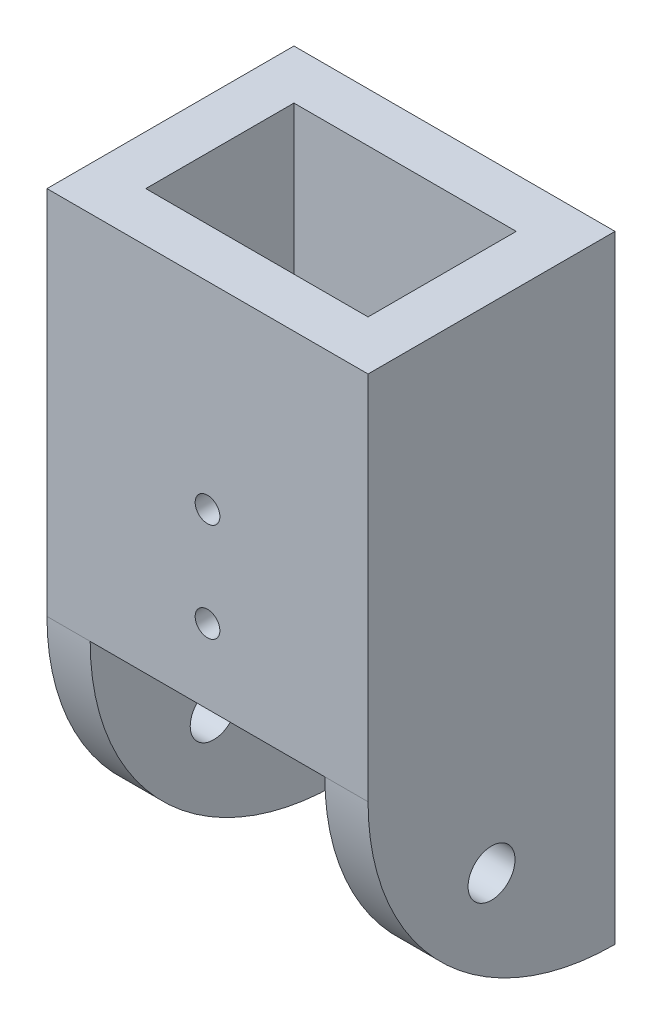
ISO-10303-21;
HEADER;
FILE_DESCRIPTION(('STEP AP214'),'2;1');
FILE_NAME('part.step','',(''),(''),'','','');
FILE_SCHEMA(('AUTOMOTIVE_DESIGN { 1 0 10303 214 1 1 1 1 }'));
ENDSEC;
DATA;
#1=APPLICATION_CONTEXT('core data for automotive mechanical design processes');
#2=APPLICATION_PROTOCOL_DEFINITION('international standard','automotive_design',2000,#1);
#3=PRODUCT_CONTEXT('',#1,'mechanical');
#4=PRODUCT('Part','Part','',(#3));
#5=PRODUCT_RELATED_PRODUCT_CATEGORY('part','',(#4));
#6=PRODUCT_DEFINITION_FORMATION('','',#4);
#7=PRODUCT_DEFINITION_CONTEXT('part definition',#1,'design');
#8=PRODUCT_DEFINITION('design','',#6,#7);
#9=PRODUCT_DEFINITION_SHAPE('','',#8);
#10=(LENGTH_UNIT() NAMED_UNIT(*) SI_UNIT(.MILLI.,.METRE.));
#11=(NAMED_UNIT(*) PLANE_ANGLE_UNIT() SI_UNIT($,.RADIAN.));
#12=(NAMED_UNIT(*) SI_UNIT($,.STERADIAN.) SOLID_ANGLE_UNIT());
#13=UNCERTAINTY_MEASURE_WITH_UNIT(LENGTH_MEASURE(1.E-05),#10,'distance_accuracy_value','');
#14=(GEOMETRIC_REPRESENTATION_CONTEXT(3) GLOBAL_UNCERTAINTY_ASSIGNED_CONTEXT((#13)) GLOBAL_UNIT_ASSIGNED_CONTEXT((#10,
#11,#12)) REPRESENTATION_CONTEXT('',''));
#15=CARTESIAN_POINT('',(0.,0.,0.));
#16=DIRECTION('',(0.,0.,1.));
#17=DIRECTION('',(1.,0.,0.));
#18=AXIS2_PLACEMENT_3D('',#15,#16,#17);
#19=CARTESIAN_POINT('',(0.,0.,0.));
#20=DIRECTION('',(0.,-1.,0.));
#21=DIRECTION('',(0.,0.,-1.));
#22=AXIS2_PLACEMENT_3D('',#19,#20,#21);
#23=PLANE('',#22);
#24=DIRECTION('',(1.,0.,0.));
#25=VECTOR('',#24,1.);
#26=CARTESIAN_POINT('',(-4.5,0.,3.));
#27=LINE('',#26,#25);
#28=CARTESIAN_POINT('',(-4.5,0.,3.));
#29=VERTEX_POINT('',#28);
#30=CARTESIAN_POINT('',(4.5,0.,3.));
#31=VERTEX_POINT('',#30);
#32=EDGE_CURVE('E254',#29,#31,#27,.T.);
#33=ORIENTED_EDGE('',*,*,#32,.T.);
#34=DIRECTION('',(0.,0.,1.));
#35=VECTOR('',#34,1.);
#36=CARTESIAN_POINT('',(4.5,0.,-5.));
#37=LINE('',#36,#35);
#38=CARTESIAN_POINT('',(4.5,0.,-3.));
#39=VERTEX_POINT('',#38);
#40=EDGE_CURVE('E526',#39,#31,#37,.T.);
#41=ORIENTED_EDGE('',*,*,#40,.F.);
#42=DIRECTION('',(-1.,0.,0.));
#43=VECTOR('',#42,1.);
#44=CARTESIAN_POINT('',(-4.5,0.,-3.));
#45=LINE('',#44,#43);
#46=CARTESIAN_POINT('',(-4.5,0.,-3.));
#47=VERTEX_POINT('',#46);
#48=EDGE_CURVE('E248',#39,#47,#45,.T.);
#49=ORIENTED_EDGE('',*,*,#48,.T.);
#50=DIRECTION('',(0.,0.,1.));
#51=VECTOR('',#50,1.);
#52=CARTESIAN_POINT('',(-4.5,0.,-5.));
#53=LINE('',#52,#51);
#54=EDGE_CURVE('E145',#47,#29,#53,.T.);
#55=ORIENTED_EDGE('',*,*,#54,.T.);
#56=EDGE_LOOP('',(#33,#41,#49,#55));
#57=FACE_BOUND('',#56,.T.);
#58=DIRECTION('',(1.,0.,0.));
#59=VECTOR('',#58,1.);
#60=CARTESIAN_POINT('',(4.5,0.,5.));
#61=LINE('',#60,#59);
#62=CARTESIAN_POINT('',(-4.75,0.,5.));
#63=VERTEX_POINT('',#62);
#64=CARTESIAN_POINT('',(4.75,0.,5.));
#65=VERTEX_POINT('',#64);
#66=EDGE_CURVE('E127',#63,#65,#61,.T.);
#67=ORIENTED_EDGE('',*,*,#66,.F.);
#68=DIRECTION('',(0.,0.,1.));
#69=VECTOR('',#68,1.);
#70=CARTESIAN_POINT('',(-4.75,0.,-5.));
#71=LINE('',#70,#69);
#72=CARTESIAN_POINT('',(-4.75,0.,-5.));
#73=VERTEX_POINT('',#72);
#74=EDGE_CURVE('E129',#73,#63,#71,.T.);
#75=ORIENTED_EDGE('',*,*,#74,.F.);
#76=DIRECTION('',(-1.,0.,0.));
#77=VECTOR('',#76,1.);
#78=CARTESIAN_POINT('',(-6.5,0.,-5.));
#79=LINE('',#78,#77);
#80=CARTESIAN_POINT('',(4.75,0.,-5.));
#81=VERTEX_POINT('',#80);
#82=EDGE_CURVE('E164',#81,#73,#79,.T.);
#83=ORIENTED_EDGE('',*,*,#82,.F.);
#84=DIRECTION('',(0.,0.,1.));
#85=VECTOR('',#84,1.);
#86=CARTESIAN_POINT('',(4.75,0.,-5.));
#87=LINE('',#86,#85);
#88=EDGE_CURVE('E59',#81,#65,#87,.T.);
#89=ORIENTED_EDGE('',*,*,#88,.T.);
#90=EDGE_LOOP('',(#67,#75,#83,#89));
#91=FACE_BOUND('',#90,.T.);
#92=ADVANCED_FACE('F41',(#57,#91),#23,.T.);
#93=CARTESIAN_POINT('',(0.,15.,0.));
#94=DIRECTION('',(0.,-1.,0.));
#95=DIRECTION('',(0.,0.,-1.));
#96=AXIS2_PLACEMENT_3D('',#93,#94,#95);
#97=PLANE('',#96);
#98=DIRECTION('',(0.,0.,-1.));
#99=VECTOR('',#98,1.);
#100=CARTESIAN_POINT('',(6.5,15.,5.));
#101=LINE('',#100,#99);
#102=CARTESIAN_POINT('',(6.5,15.,5.));
#103=VERTEX_POINT('',#102);
#104=CARTESIAN_POINT('',(6.5,15.,-5.));
#105=VERTEX_POINT('',#104);
#106=EDGE_CURVE('E163',#103,#105,#101,.T.);
#107=ORIENTED_EDGE('',*,*,#106,.T.);
#108=DIRECTION('',(-1.,0.,0.));
#109=VECTOR('',#108,1.);
#110=CARTESIAN_POINT('',(-6.5,15.,-5.));
#111=LINE('',#110,#109);
#112=CARTESIAN_POINT('',(-6.5,15.,-5.));
#113=VERTEX_POINT('',#112);
#114=EDGE_CURVE('E169',#105,#113,#111,.T.);
#115=ORIENTED_EDGE('',*,*,#114,.T.);
#116=DIRECTION('',(0.,0.,1.));
#117=VECTOR('',#116,1.);
#118=CARTESIAN_POINT('',(-6.5,15.,5.));
#119=LINE('',#118,#117);
#120=CARTESIAN_POINT('',(-6.5,15.,5.));
#121=VERTEX_POINT('',#120);
#122=EDGE_CURVE('E284',#113,#121,#119,.T.);
#123=ORIENTED_EDGE('',*,*,#122,.T.);
#124=DIRECTION('',(1.,0.,0.));
#125=VECTOR('',#124,1.);
#126=CARTESIAN_POINT('',(-6.5,15.,5.));
#127=LINE('',#126,#125);
#128=EDGE_CURVE('E179',#121,#103,#127,.T.);
#129=ORIENTED_EDGE('',*,*,#128,.T.);
#130=EDGE_LOOP('',(#107,#115,#123,#129));
#131=FACE_BOUND('',#130,.T.);
#132=DIRECTION('',(0.,0.,-1.));
#133=VECTOR('',#132,1.);
#134=CARTESIAN_POINT('',(4.5,15.,3.));
#135=LINE('',#134,#133);
#136=CARTESIAN_POINT('',(4.5,15.,3.));
#137=VERTEX_POINT('',#136);
#138=CARTESIAN_POINT('',(4.5,15.,-3.));
#139=VERTEX_POINT('',#138);
#140=EDGE_CURVE('E250',#137,#139,#135,.T.);
#141=ORIENTED_EDGE('',*,*,#140,.F.);
#142=DIRECTION('',(1.,0.,0.));
#143=VECTOR('',#142,1.);
#144=CARTESIAN_POINT('',(-4.5,15.,3.));
#145=LINE('',#144,#143);
#146=CARTESIAN_POINT('',(-4.5,15.,3.));
#147=VERTEX_POINT('',#146);
#148=EDGE_CURVE('E260',#147,#137,#145,.T.);
#149=ORIENTED_EDGE('',*,*,#148,.F.);
#150=DIRECTION('',(0.,0.,1.));
#151=VECTOR('',#150,1.);
#152=CARTESIAN_POINT('',(-4.5,15.,3.));
#153=LINE('',#152,#151);
#154=CARTESIAN_POINT('',(-4.5,15.,-3.));
#155=VERTEX_POINT('',#154);
#156=EDGE_CURVE('E257',#155,#147,#153,.T.);
#157=ORIENTED_EDGE('',*,*,#156,.F.);
#158=DIRECTION('',(-1.,0.,0.));
#159=VECTOR('',#158,1.);
#160=CARTESIAN_POINT('',(-4.5,15.,-3.));
#161=LINE('',#160,#159);
#162=EDGE_CURVE('E253',#139,#155,#161,.T.);
#163=ORIENTED_EDGE('',*,*,#162,.F.);
#164=EDGE_LOOP('',(#141,#149,#157,#163));
#165=FACE_BOUND('',#164,.T.);
#166=ADVANCED_FACE('F289',(#131,#165),#97,.F.);
#167=CARTESIAN_POINT('',(6.5,15.,5.));
#168=DIRECTION('',(-1.,0.,0.));
#169=DIRECTION('',(0.,0.,1.));
#170=AXIS2_PLACEMENT_3D('',#167,#168,#169);
#171=PLANE('',#170);
#172=CARTESIAN_POINT('',(6.5,-5.,0.));
#173=DIRECTION('',(1.,0.,0.));
#174=DIRECTION('',(0.,0.,-1.));
#175=AXIS2_PLACEMENT_3D('',#172,#173,#174);
#176=CIRCLE('',#175,0.95);
#177=CARTESIAN_POINT('',(6.5,-5.,-0.949999999999999));
#178=VERTEX_POINT('',#177);
#179=EDGE_CURVE('E230',#178,#178,#176,.T.);
#180=ORIENTED_EDGE('',*,*,#179,.F.);
#181=EDGE_LOOP('',(#180));
#182=FACE_BOUND('',#181,.T.);
#183=DIRECTION('',(0.,-1.,0.));
#184=VECTOR('',#183,1.);
#185=CARTESIAN_POINT('',(6.5,15.,5.));
#186=LINE('',#185,#184);
#187=CARTESIAN_POINT('',(6.5,0.,5.));
#188=VERTEX_POINT('',#187);
#189=EDGE_CURVE('E175',#103,#188,#186,.T.);
#190=ORIENTED_EDGE('',*,*,#189,.T.);
#191=CARTESIAN_POINT('',(6.5,0.,-5.));
#192=DIRECTION('',(1.,0.,0.));
#193=DIRECTION('',(0.,0.,-1.));
#194=AXIS2_PLACEMENT_3D('',#191,#192,#193);
#195=CIRCLE('',#194,10.);
#196=CARTESIAN_POINT('',(6.5,-10.,-5.));
#197=VERTEX_POINT('',#196);
#198=EDGE_CURVE('E243',#188,#197,#195,.T.);
#199=ORIENTED_EDGE('',*,*,#198,.T.);
#200=DIRECTION('',(0.,-1.,0.));
#201=VECTOR('',#200,1.);
#202=CARTESIAN_POINT('',(6.5,15.,-5.));
#203=LINE('',#202,#201);
#204=EDGE_CURVE('E11',#105,#197,#203,.T.);
#205=ORIENTED_EDGE('',*,*,#204,.F.);
#206=ORIENTED_EDGE('',*,*,#106,.F.);
#207=EDGE_LOOP('',(#190,#199,#205,#206));
#208=FACE_BOUND('',#207,.T.);
#209=ADVANCED_FACE('F43',(#182,#208),#171,.F.);
#210=CARTESIAN_POINT('',(-6.5,15.,-5.));
#211=DIRECTION('',(0.,0.,1.));
#212=DIRECTION('',(1.,0.,0.));
#213=AXIS2_PLACEMENT_3D('',#210,#211,#212);
#214=PLANE('',#213);
#215=CARTESIAN_POINT('',(0.,3.,-5.));
#216=DIRECTION('',(0.,0.,1.));
#217=DIRECTION('',(1.,0.,0.));
#218=AXIS2_PLACEMENT_3D('',#215,#216,#217);
#219=CIRCLE('',#218,0.5);
#220=CARTESIAN_POINT('',(0.5,3.,-5.));
#221=VERTEX_POINT('',#220);
#222=EDGE_CURVE('E190',#221,#221,#219,.T.);
#223=ORIENTED_EDGE('',*,*,#222,.T.);
#224=EDGE_LOOP('',(#223));
#225=FACE_BOUND('',#224,.T.);
#226=CARTESIAN_POINT('',(0.,7.,-5.));
#227=DIRECTION('',(0.,0.,1.));
#228=DIRECTION('',(1.,0.,0.));
#229=AXIS2_PLACEMENT_3D('',#226,#227,#228);
#230=CIRCLE('',#229,0.5);
#231=CARTESIAN_POINT('',(0.5,7.,-5.));
#232=VERTEX_POINT('',#231);
#233=EDGE_CURVE('E217',#232,#232,#230,.T.);
#234=ORIENTED_EDGE('',*,*,#233,.T.);
#235=EDGE_LOOP('',(#234));
#236=FACE_BOUND('',#235,.T.);
#237=ORIENTED_EDGE('',*,*,#82,.T.);
#238=DIRECTION('',(0.,-1.,0.));
#239=VECTOR('',#238,1.);
#240=CARTESIAN_POINT('',(-4.75,-10.,-5.));
#241=LINE('',#240,#239);
#242=CARTESIAN_POINT('',(-4.75,-10.,-5.));
#243=VERTEX_POINT('',#242);
#244=EDGE_CURVE('E142',#73,#243,#241,.T.);
#245=ORIENTED_EDGE('',*,*,#244,.T.);
#246=DIRECTION('',(-1.,0.,0.));
#247=VECTOR('',#246,1.);
#248=CARTESIAN_POINT('',(-4.5,-10.,-5.));
#249=LINE('',#248,#247);
#250=CARTESIAN_POINT('',(-6.5,-10.,-5.));
#251=VERTEX_POINT('',#250);
#252=EDGE_CURVE('E154',#243,#251,#249,.T.);
#253=ORIENTED_EDGE('',*,*,#252,.T.);
#254=DIRECTION('',(0.,-1.,0.));
#255=VECTOR('',#254,1.);
#256=CARTESIAN_POINT('',(-6.5,15.,-5.));
#257=LINE('',#256,#255);
#258=EDGE_CURVE('E51',#113,#251,#257,.T.);
#259=ORIENTED_EDGE('',*,*,#258,.F.);
#260=ORIENTED_EDGE('',*,*,#114,.F.);
#261=ORIENTED_EDGE('',*,*,#204,.T.);
#262=DIRECTION('',(1.,0.,0.));
#263=VECTOR('',#262,1.);
#264=CARTESIAN_POINT('',(4.5,-10.,-5.));
#265=LINE('',#264,#263);
#266=CARTESIAN_POINT('',(4.75,-10.,-5.));
#267=VERTEX_POINT('',#266);
#268=EDGE_CURVE('E134',#267,#197,#265,.T.);
#269=ORIENTED_EDGE('',*,*,#268,.F.);
#270=DIRECTION('',(0.,1.,0.));
#271=VECTOR('',#270,1.);
#272=CARTESIAN_POINT('',(4.75,-10.,-5.));
#273=LINE('',#272,#271);
#274=EDGE_CURVE('E535',#267,#81,#273,.T.);
#275=ORIENTED_EDGE('',*,*,#274,.T.);
#276=EDGE_LOOP('',(#237,#245,#253,#259,#260,#261,#269,#275));
#277=FACE_BOUND('',#276,.T.);
#278=ADVANCED_FACE('F298',(#225,#236,#277),#214,.F.);
#279=CARTESIAN_POINT('',(-6.5,15.,5.));
#280=DIRECTION('',(1.,0.,0.));
#281=DIRECTION('',(0.,0.,-1.));
#282=AXIS2_PLACEMENT_3D('',#279,#280,#281);
#283=PLANE('',#282);
#284=CARTESIAN_POINT('',(-6.5,-5.,0.));
#285=DIRECTION('',(1.,0.,0.));
#286=DIRECTION('',(0.,0.,-1.));
#287=AXIS2_PLACEMENT_3D('',#284,#285,#286);
#288=CIRCLE('',#287,0.95);
#289=CARTESIAN_POINT('',(-6.5,-5.,-0.949999999999999));
#290=VERTEX_POINT('',#289);
#291=EDGE_CURVE('E231',#290,#290,#288,.T.);
#292=ORIENTED_EDGE('',*,*,#291,.T.);
#293=EDGE_LOOP('',(#292));
#294=FACE_BOUND('',#293,.T.);
#295=ORIENTED_EDGE('',*,*,#258,.T.);
#296=CARTESIAN_POINT('',(-6.5,0.,-5.));
#297=DIRECTION('',(1.,0.,0.));
#298=DIRECTION('',(0.,0.,-1.));
#299=AXIS2_PLACEMENT_3D('',#296,#297,#298);
#300=CIRCLE('',#299,10.);
#301=CARTESIAN_POINT('',(-6.5,0.,5.));
#302=VERTEX_POINT('',#301);
#303=EDGE_CURVE('E235',#302,#251,#300,.T.);
#304=ORIENTED_EDGE('',*,*,#303,.F.);
#305=DIRECTION('',(0.,-1.,0.));
#306=VECTOR('',#305,1.);
#307=CARTESIAN_POINT('',(-6.5,15.,5.));
#308=LINE('',#307,#306);
#309=EDGE_CURVE('E161',#121,#302,#308,.T.);
#310=ORIENTED_EDGE('',*,*,#309,.F.);
#311=ORIENTED_EDGE('',*,*,#122,.F.);
#312=EDGE_LOOP('',(#295,#304,#310,#311));
#313=FACE_BOUND('',#312,.T.);
#314=ADVANCED_FACE('F302',(#294,#313),#283,.F.);
#315=CARTESIAN_POINT('',(-6.5,15.,5.));
#316=DIRECTION('',(0.,0.,-1.));
#317=DIRECTION('',(-1.,0.,0.));
#318=AXIS2_PLACEMENT_3D('',#315,#316,#317);
#319=PLANE('',#318);
#320=CARTESIAN_POINT('',(0.,3.,5.));
#321=DIRECTION('',(0.,0.,1.));
#322=DIRECTION('',(1.,0.,0.));
#323=AXIS2_PLACEMENT_3D('',#320,#321,#322);
#324=CIRCLE('',#323,0.5);
#325=CARTESIAN_POINT('',(0.5,3.,5.));
#326=VERTEX_POINT('',#325);
#327=EDGE_CURVE('E213',#326,#326,#324,.T.);
#328=ORIENTED_EDGE('',*,*,#327,.F.);
#329=EDGE_LOOP('',(#328));
#330=FACE_BOUND('',#329,.T.);
#331=CARTESIAN_POINT('',(0.,7.,5.));
#332=DIRECTION('',(0.,0.,1.));
#333=DIRECTION('',(1.,0.,0.));
#334=AXIS2_PLACEMENT_3D('',#331,#332,#333);
#335=CIRCLE('',#334,0.5);
#336=CARTESIAN_POINT('',(0.5,7.,5.));
#337=VERTEX_POINT('',#336);
#338=EDGE_CURVE('E156',#337,#337,#335,.T.);
#339=ORIENTED_EDGE('',*,*,#338,.F.);
#340=EDGE_LOOP('',(#339));
#341=FACE_BOUND('',#340,.T.);
#342=DIRECTION('',(1.,0.,0.));
#343=VECTOR('',#342,1.);
#344=CARTESIAN_POINT('',(-6.5,0.,5.));
#345=LINE('',#344,#343);
#346=EDGE_CURVE('E152',#302,#63,#345,.T.);
#347=ORIENTED_EDGE('',*,*,#346,.T.);
#348=ORIENTED_EDGE('',*,*,#66,.T.);
#349=EDGE_CURVE('E135',#65,#188,#61,.T.);
#350=ORIENTED_EDGE('',*,*,#349,.T.);
#351=ORIENTED_EDGE('',*,*,#189,.F.);
#352=ORIENTED_EDGE('',*,*,#128,.F.);
#353=ORIENTED_EDGE('',*,*,#309,.T.);
#354=EDGE_LOOP('',(#347,#348,#350,#351,#352,#353));
#355=FACE_BOUND('',#354,.T.);
#356=ADVANCED_FACE('F158',(#330,#341,#355),#319,.F.);
#357=CARTESIAN_POINT('',(4.5,15.,3.));
#358=DIRECTION('',(-1.,0.,0.));
#359=DIRECTION('',(0.,0.,1.));
#360=AXIS2_PLACEMENT_3D('',#357,#358,#359);
#361=PLANE('',#360);
#362=ORIENTED_EDGE('',*,*,#40,.T.);
#363=DIRECTION('',(0.,-1.,0.));
#364=VECTOR('',#363,1.);
#365=CARTESIAN_POINT('',(4.5,15.,3.));
#366=LINE('',#365,#364);
#367=EDGE_CURVE('E263',#137,#31,#366,.T.);
#368=ORIENTED_EDGE('',*,*,#367,.F.);
#369=ORIENTED_EDGE('',*,*,#140,.T.);
#370=DIRECTION('',(0.,-1.,0.));
#371=VECTOR('',#370,1.);
#372=CARTESIAN_POINT('',(4.5,15.,-3.));
#373=LINE('',#372,#371);
#374=EDGE_CURVE('E171',#139,#39,#373,.T.);
#375=ORIENTED_EDGE('',*,*,#374,.T.);
#376=EDGE_LOOP('',(#362,#368,#369,#375));
#377=FACE_BOUND('',#376,.T.);
#378=ADVANCED_FACE('F310',(#377),#361,.T.);
#379=CARTESIAN_POINT('',(-4.5,15.,-3.));
#380=DIRECTION('',(0.,0.,1.));
#381=DIRECTION('',(1.,0.,0.));
#382=AXIS2_PLACEMENT_3D('',#379,#380,#381);
#383=PLANE('',#382);
#384=CARTESIAN_POINT('',(0.,3.,-3.));
#385=DIRECTION('',(0.,0.,1.));
#386=DIRECTION('',(1.,0.,0.));
#387=AXIS2_PLACEMENT_3D('',#384,#385,#386);
#388=CIRCLE('',#387,0.5);
#389=CARTESIAN_POINT('',(0.5,3.,-3.));
#390=VERTEX_POINT('',#389);
#391=EDGE_CURVE('E194',#390,#390,#388,.T.);
#392=ORIENTED_EDGE('',*,*,#391,.F.);
#393=EDGE_LOOP('',(#392));
#394=FACE_BOUND('',#393,.T.);
#395=CARTESIAN_POINT('',(0.,7.,-3.));
#396=DIRECTION('',(0.,0.,1.));
#397=DIRECTION('',(1.,0.,0.));
#398=AXIS2_PLACEMENT_3D('',#395,#396,#397);
#399=CIRCLE('',#398,0.5);
#400=CARTESIAN_POINT('',(0.5,7.,-3.));
#401=VERTEX_POINT('',#400);
#402=EDGE_CURVE('E189',#401,#401,#399,.T.);
#403=ORIENTED_EDGE('',*,*,#402,.F.);
#404=EDGE_LOOP('',(#403));
#405=FACE_BOUND('',#404,.T.);
#406=ORIENTED_EDGE('',*,*,#48,.F.);
#407=ORIENTED_EDGE('',*,*,#374,.F.);
#408=ORIENTED_EDGE('',*,*,#162,.T.);
#409=DIRECTION('',(0.,-1.,0.));
#410=VECTOR('',#409,1.);
#411=CARTESIAN_POINT('',(-4.5,15.,-3.));
#412=LINE('',#411,#410);
#413=EDGE_CURVE('E275',#155,#47,#412,.T.);
#414=ORIENTED_EDGE('',*,*,#413,.T.);
#415=EDGE_LOOP('',(#406,#407,#408,#414));
#416=FACE_BOUND('',#415,.T.);
#417=ADVANCED_FACE('F324',(#394,#405,#416),#383,.T.);
#418=CARTESIAN_POINT('',(-4.5,15.,3.));
#419=DIRECTION('',(1.,0.,0.));
#420=DIRECTION('',(0.,0.,-1.));
#421=AXIS2_PLACEMENT_3D('',#418,#419,#420);
#422=PLANE('',#421);
#423=ORIENTED_EDGE('',*,*,#54,.F.);
#424=ORIENTED_EDGE('',*,*,#413,.F.);
#425=ORIENTED_EDGE('',*,*,#156,.T.);
#426=DIRECTION('',(0.,-1.,0.));
#427=VECTOR('',#426,1.);
#428=CARTESIAN_POINT('',(-4.5,15.,3.));
#429=LINE('',#428,#427);
#430=EDGE_CURVE('E67',#147,#29,#429,.T.);
#431=ORIENTED_EDGE('',*,*,#430,.T.);
#432=EDGE_LOOP('',(#423,#424,#425,#431));
#433=FACE_BOUND('',#432,.T.);
#434=ADVANCED_FACE('F328',(#433),#422,.T.);
#435=CARTESIAN_POINT('',(-4.5,15.,3.));
#436=DIRECTION('',(0.,0.,-1.));
#437=DIRECTION('',(-1.,0.,0.));
#438=AXIS2_PLACEMENT_3D('',#435,#436,#437);
#439=PLANE('',#438);
#440=CARTESIAN_POINT('',(0.,3.,3.));
#441=DIRECTION('',(0.,0.,-1.));
#442=DIRECTION('',(-1.,0.,0.));
#443=AXIS2_PLACEMENT_3D('',#440,#441,#442);
#444=CIRCLE('',#443,0.5);
#445=CARTESIAN_POINT('',(-0.5,3.,3.));
#446=VERTEX_POINT('',#445);
#447=EDGE_CURVE('E191',#446,#446,#444,.T.);
#448=ORIENTED_EDGE('',*,*,#447,.F.);
#449=EDGE_LOOP('',(#448));
#450=FACE_BOUND('',#449,.T.);
#451=CARTESIAN_POINT('',(0.,7.,3.));
#452=DIRECTION('',(0.,0.,-1.));
#453=DIRECTION('',(-1.,0.,0.));
#454=AXIS2_PLACEMENT_3D('',#451,#452,#453);
#455=CIRCLE('',#454,0.5);
#456=CARTESIAN_POINT('',(-0.5,7.,3.));
#457=VERTEX_POINT('',#456);
#458=EDGE_CURVE('E185',#457,#457,#455,.T.);
#459=ORIENTED_EDGE('',*,*,#458,.F.);
#460=EDGE_LOOP('',(#459));
#461=FACE_BOUND('',#460,.T.);
#462=ORIENTED_EDGE('',*,*,#32,.F.);
#463=ORIENTED_EDGE('',*,*,#430,.F.);
#464=ORIENTED_EDGE('',*,*,#148,.T.);
#465=ORIENTED_EDGE('',*,*,#367,.T.);
#466=EDGE_LOOP('',(#462,#463,#464,#465));
#467=FACE_BOUND('',#466,.T.);
#468=ADVANCED_FACE('F332',(#450,#461,#467),#439,.T.);
#469=CARTESIAN_POINT('',(4.5,0.,-5.));
#470=DIRECTION('',(1.,0.,0.));
#471=DIRECTION('',(0.,0.,-1.));
#472=AXIS2_PLACEMENT_3D('',#469,#470,#471);
#473=CYLINDRICAL_SURFACE('',#472,10.);
#474=CARTESIAN_POINT('',(4.75,0.,-5.));
#475=DIRECTION('',(1.,0.,0.));
#476=DIRECTION('',(0.,0.,-1.));
#477=AXIS2_PLACEMENT_3D('',#474,#475,#476);
#478=CIRCLE('',#477,10.);
#479=EDGE_CURVE('E197',#267,#65,#478,.F.);
#480=ORIENTED_EDGE('',*,*,#479,.F.);
#481=ORIENTED_EDGE('',*,*,#268,.T.);
#482=ORIENTED_EDGE('',*,*,#198,.F.);
#483=ORIENTED_EDGE('',*,*,#349,.F.);
#484=EDGE_LOOP('',(#480,#481,#482,#483));
#485=FACE_BOUND('',#484,.T.);
#486=ADVANCED_FACE('F336',(#485),#473,.T.);
#487=CARTESIAN_POINT('',(-4.5,0.,-5.));
#488=DIRECTION('',(-1.,0.,0.));
#489=DIRECTION('',(0.,0.,1.));
#490=AXIS2_PLACEMENT_3D('',#487,#488,#489);
#491=CYLINDRICAL_SURFACE('',#490,10.);
#492=ORIENTED_EDGE('',*,*,#252,.F.);
#493=CARTESIAN_POINT('',(-4.75,0.,-5.));
#494=DIRECTION('',(-1.,0.,0.));
#495=DIRECTION('',(0.,0.,1.));
#496=AXIS2_PLACEMENT_3D('',#493,#494,#495);
#497=CIRCLE('',#496,10.);
#498=EDGE_CURVE('E140',#243,#63,#497,.T.);
#499=ORIENTED_EDGE('',*,*,#498,.T.);
#500=ORIENTED_EDGE('',*,*,#346,.F.);
#501=ORIENTED_EDGE('',*,*,#303,.T.);
#502=EDGE_LOOP('',(#492,#499,#500,#501));
#503=FACE_BOUND('',#502,.T.);
#504=ADVANCED_FACE('F150',(#503),#491,.T.);
#505=CARTESIAN_POINT('',(-6.5,-5.,0.));
#506=DIRECTION('',(1.,0.,0.));
#507=DIRECTION('',(0.,0.,-1.));
#508=AXIS2_PLACEMENT_3D('',#505,#506,#507);
#509=CYLINDRICAL_SURFACE('',#508,0.95);
#510=CARTESIAN_POINT('',(-4.75,-5.,0.));
#511=DIRECTION('',(-1.,0.,0.));
#512=DIRECTION('',(0.,0.,1.));
#513=AXIS2_PLACEMENT_3D('',#510,#511,#512);
#514=CIRCLE('',#513,0.95);
#515=CARTESIAN_POINT('',(-4.75,-5.,0.950000000000001));
#516=VERTEX_POINT('',#515);
#517=EDGE_CURVE('E45',#516,#516,#514,.F.);
#518=ORIENTED_EDGE('',*,*,#517,.T.);
#519=EDGE_LOOP('',(#518));
#520=FACE_BOUND('',#519,.T.);
#521=ORIENTED_EDGE('',*,*,#291,.F.);
#522=EDGE_LOOP('',(#521));
#523=FACE_BOUND('',#522,.T.);
#524=ADVANCED_FACE('F343',(#520,#523),#509,.F.);
#525=CARTESIAN_POINT('',(4.75,-5.,0.));
#526=DIRECTION('',(1.,0.,0.));
#527=DIRECTION('',(0.,0.,-1.));
#528=AXIS2_PLACEMENT_3D('',#525,#526,#527);
#529=CIRCLE('',#528,0.95);
#530=CARTESIAN_POINT('',(4.75,-5.,-0.949999999999999));
#531=VERTEX_POINT('',#530);
#532=EDGE_CURVE('E144',#531,#531,#529,.F.);
#533=ORIENTED_EDGE('',*,*,#532,.T.);
#534=EDGE_LOOP('',(#533));
#535=FACE_BOUND('',#534,.T.);
#536=ORIENTED_EDGE('',*,*,#179,.T.);
#537=EDGE_LOOP('',(#536));
#538=FACE_BOUND('',#537,.T.);
#539=ADVANCED_FACE('F346',(#535,#538),#509,.F.);
#540=CARTESIAN_POINT('',(0.,7.,-5.));
#541=DIRECTION('',(0.,0.,1.));
#542=DIRECTION('',(1.,0.,0.));
#543=AXIS2_PLACEMENT_3D('',#540,#541,#542);
#544=CYLINDRICAL_SURFACE('',#543,0.5);
#545=ORIENTED_EDGE('',*,*,#458,.T.);
#546=EDGE_LOOP('',(#545));
#547=FACE_BOUND('',#546,.T.);
#548=ORIENTED_EDGE('',*,*,#338,.T.);
#549=EDGE_LOOP('',(#548));
#550=FACE_BOUND('',#549,.T.);
#551=ADVANCED_FACE('F348',(#547,#550),#544,.F.);
#552=CARTESIAN_POINT('',(0.,3.,-5.));
#553=DIRECTION('',(0.,0.,1.));
#554=DIRECTION('',(1.,0.,0.));
#555=AXIS2_PLACEMENT_3D('',#552,#553,#554);
#556=CYLINDRICAL_SURFACE('',#555,0.5);
#557=ORIENTED_EDGE('',*,*,#447,.T.);
#558=EDGE_LOOP('',(#557));
#559=FACE_BOUND('',#558,.T.);
#560=ORIENTED_EDGE('',*,*,#327,.T.);
#561=EDGE_LOOP('',(#560));
#562=FACE_BOUND('',#561,.T.);
#563=ADVANCED_FACE('F351',(#559,#562),#556,.F.);
#564=ORIENTED_EDGE('',*,*,#402,.T.);
#565=EDGE_LOOP('',(#564));
#566=FACE_BOUND('',#565,.T.);
#567=ORIENTED_EDGE('',*,*,#233,.F.);
#568=EDGE_LOOP('',(#567));
#569=FACE_BOUND('',#568,.T.);
#570=ADVANCED_FACE('F353',(#566,#569),#544,.F.);
#571=ORIENTED_EDGE('',*,*,#391,.T.);
#572=EDGE_LOOP('',(#571));
#573=FACE_BOUND('',#572,.T.);
#574=ORIENTED_EDGE('',*,*,#222,.F.);
#575=EDGE_LOOP('',(#574));
#576=FACE_BOUND('',#575,.T.);
#577=ADVANCED_FACE('F357',(#573,#576),#556,.F.);
#578=CARTESIAN_POINT('',(4.75,-10.,-5.));
#579=DIRECTION('',(1.,0.,0.));
#580=DIRECTION('',(0.,0.,-1.));
#581=AXIS2_PLACEMENT_3D('',#578,#579,#580);
#582=PLANE('',#581);
#583=ORIENTED_EDGE('',*,*,#479,.T.);
#584=ORIENTED_EDGE('',*,*,#88,.F.);
#585=ORIENTED_EDGE('',*,*,#274,.F.);
#586=EDGE_LOOP('',(#583,#584,#585));
#587=FACE_BOUND('',#586,.T.);
#588=ORIENTED_EDGE('',*,*,#532,.F.);
#589=EDGE_LOOP('',(#588));
#590=FACE_BOUND('',#589,.T.);
#591=ADVANCED_FACE('F358',(#587,#590),#582,.F.);
#592=CARTESIAN_POINT('',(-4.75,-10.,-5.));
#593=DIRECTION('',(-1.,0.,0.));
#594=DIRECTION('',(0.,0.,1.));
#595=AXIS2_PLACEMENT_3D('',#592,#593,#594);
#596=PLANE('',#595);
#597=ORIENTED_EDGE('',*,*,#517,.F.);
#598=EDGE_LOOP('',(#597));
#599=FACE_BOUND('',#598,.T.);
#600=ORIENTED_EDGE('',*,*,#244,.F.);
#601=ORIENTED_EDGE('',*,*,#74,.T.);
#602=ORIENTED_EDGE('',*,*,#498,.F.);
#603=EDGE_LOOP('',(#600,#601,#602));
#604=FACE_BOUND('',#603,.T.);
#605=ADVANCED_FACE('F139',(#599,#604),#596,.F.);
#606=CLOSED_SHELL('',(#92,#166,#209,#278,#314,#356,#378,#417,#434,#468,#486,#504,#524,#539,#551,
#563,#570,#577,#591,#605));
#607=MANIFOLD_SOLID_BREP('B2',#606);
#608=ADVANCED_BREP_SHAPE_REPRESENTATION('',(#18,#607),#14);
#609=SHAPE_DEFINITION_REPRESENTATION(#9,#608);
ENDSEC;
END-ISO-10303-21;
